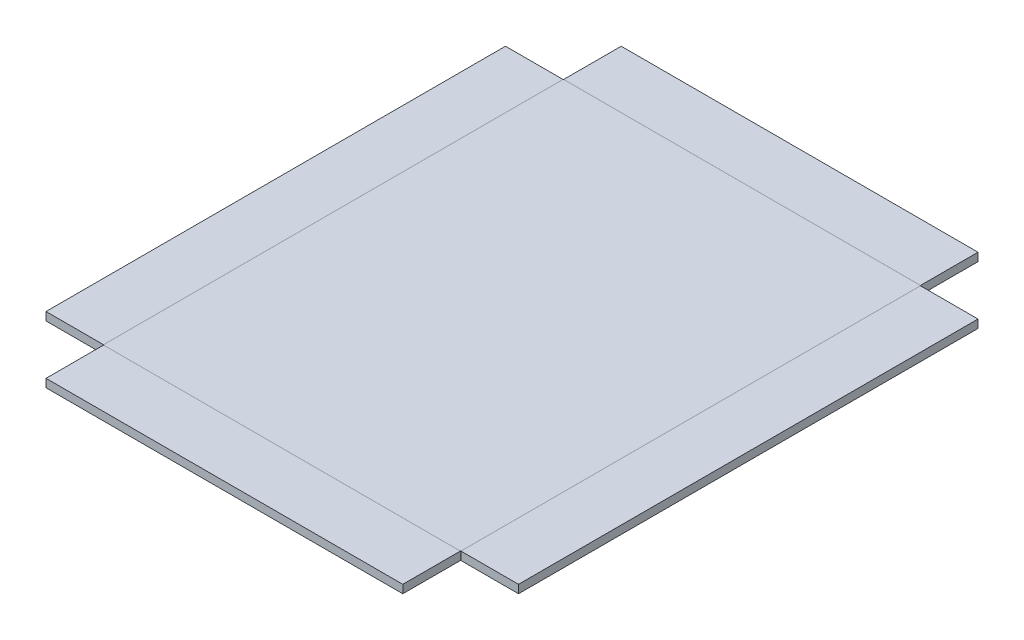
ISO-10303-21;
HEADER;
FILE_DESCRIPTION(('STEP AP214'),'2;1');
FILE_NAME('part.step','',(''),(''),'','','');
FILE_SCHEMA(('AUTOMOTIVE_DESIGN { 1 0 10303 214 1 1 1 1 }'));
ENDSEC;
DATA;
#1=APPLICATION_CONTEXT('core data for automotive mechanical design processes');
#2=APPLICATION_PROTOCOL_DEFINITION('international standard','automotive_design',2000,#1);
#3=PRODUCT_CONTEXT('',#1,'mechanical');
#4=PRODUCT('Part','Part','',(#3));
#5=PRODUCT_RELATED_PRODUCT_CATEGORY('part','',(#4));
#6=PRODUCT_DEFINITION_FORMATION('','',#4);
#7=PRODUCT_DEFINITION_CONTEXT('part definition',#1,'design');
#8=PRODUCT_DEFINITION('design','',#6,#7);
#9=PRODUCT_DEFINITION_SHAPE('','',#8);
#10=(LENGTH_UNIT() NAMED_UNIT(*) SI_UNIT(.MILLI.,.METRE.));
#11=(NAMED_UNIT(*) PLANE_ANGLE_UNIT() SI_UNIT($,.RADIAN.));
#12=(NAMED_UNIT(*) SI_UNIT($,.STERADIAN.) SOLID_ANGLE_UNIT());
#13=UNCERTAINTY_MEASURE_WITH_UNIT(LENGTH_MEASURE(1.E-05),#10,'distance_accuracy_value','');
#14=(GEOMETRIC_REPRESENTATION_CONTEXT(3) GLOBAL_UNCERTAINTY_ASSIGNED_CONTEXT((#13)) GLOBAL_UNIT_ASSIGNED_CONTEXT((#10,
#11,#12)) REPRESENTATION_CONTEXT('',''));
#15=CARTESIAN_POINT('',(0.,0.,0.));
#16=DIRECTION('',(0.,0.,1.));
#17=DIRECTION('',(1.,0.,0.));
#18=AXIS2_PLACEMENT_3D('',#15,#16,#17);
#19=CARTESIAN_POINT('',(0.,-0.254,0.));
#20=DIRECTION('',(0.,-1.,0.));
#21=DIRECTION('',(0.,0.,-1.));
#22=AXIS2_PLACEMENT_3D('',#19,#20,#21);
#23=PLANE('',#22);
#24=DIRECTION('',(0.,0.,-1.));
#25=VECTOR('',#24,1.);
#26=CARTESIAN_POINT('',(5.5245,-0.254,7.112));
#27=LINE('',#26,#25);
#28=CARTESIAN_POINT('',(5.5245,-0.254,7.112));
#29=VERTEX_POINT('',#28);
#30=CARTESIAN_POINT('',(5.5245,-0.254,-7.112));
#31=VERTEX_POINT('',#30);
#32=EDGE_CURVE('E739',#29,#31,#27,.T.);
#33=ORIENTED_EDGE('',*,*,#32,.F.);
#34=DIRECTION('',(1.,0.,0.));
#35=VECTOR('',#34,1.);
#36=CARTESIAN_POINT('',(-5.5245,-0.254,7.112));
#37=LINE('',#36,#35);
#38=CARTESIAN_POINT('',(-5.5245,-0.254,7.112));
#39=VERTEX_POINT('',#38);
#40=EDGE_CURVE('E347',#39,#29,#37,.T.);
#41=ORIENTED_EDGE('',*,*,#40,.F.);
#42=DIRECTION('',(0.,0.,1.));
#43=VECTOR('',#42,1.);
#44=CARTESIAN_POINT('',(-5.5245,-0.254,7.112));
#45=LINE('',#44,#43);
#46=CARTESIAN_POINT('',(-5.5245,-0.254,-7.112));
#47=VERTEX_POINT('',#46);
#48=EDGE_CURVE('E340',#47,#39,#45,.T.);
#49=ORIENTED_EDGE('',*,*,#48,.F.);
#50=DIRECTION('',(-1.,0.,0.));
#51=VECTOR('',#50,1.);
#52=CARTESIAN_POINT('',(-5.5245,-0.254,-7.112));
#53=LINE('',#52,#51);
#54=EDGE_CURVE('E727',#31,#47,#53,.T.);
#55=ORIENTED_EDGE('',*,*,#54,.F.);
#56=EDGE_LOOP('',(#33,#41,#49,#55));
#57=FACE_BOUND('',#56,.T.);
#58=ADVANCED_FACE('F331',(#57),#23,.T.);
#59=CARTESIAN_POINT('',(0.,0.,0.));
#60=DIRECTION('',(0.,-1.,0.));
#61=DIRECTION('',(0.,0.,-1.));
#62=AXIS2_PLACEMENT_3D('',#59,#60,#61);
#63=PLANE('',#62);
#64=DIRECTION('',(0.,0.,-1.));
#65=VECTOR('',#64,1.);
#66=CARTESIAN_POINT('',(5.5245,0.,7.112));
#67=LINE('',#66,#65);
#68=CARTESIAN_POINT('',(5.5245,0.,7.11199999999999));
#69=VERTEX_POINT('',#68);
#70=CARTESIAN_POINT('',(5.52449999999999,0.,-7.112));
#71=VERTEX_POINT('',#70);
#72=EDGE_CURVE('E730',#69,#71,#67,.T.);
#73=ORIENTED_EDGE('',*,*,#72,.T.);
#74=DIRECTION('',(-1.,0.,0.));
#75=VECTOR('',#74,1.);
#76=CARTESIAN_POINT('',(-5.5245,0.,-7.112));
#77=LINE('',#76,#75);
#78=CARTESIAN_POINT('',(-5.5245,0.,-7.11199999999999));
#79=VERTEX_POINT('',#78);
#80=EDGE_CURVE('E719',#71,#79,#77,.T.);
#81=ORIENTED_EDGE('',*,*,#80,.T.);
#82=DIRECTION('',(0.,0.,1.));
#83=VECTOR('',#82,1.);
#84=CARTESIAN_POINT('',(-5.5245,0.,7.112));
#85=LINE('',#84,#83);
#86=CARTESIAN_POINT('',(-5.52449999999998,0.,7.112));
#87=VERTEX_POINT('',#86);
#88=EDGE_CURVE('E764',#79,#87,#85,.T.);
#89=ORIENTED_EDGE('',*,*,#88,.T.);
#90=DIRECTION('',(1.,0.,0.));
#91=VECTOR('',#90,1.);
#92=CARTESIAN_POINT('',(-5.5245,0.,7.112));
#93=LINE('',#92,#91);
#94=EDGE_CURVE('E749',#87,#69,#93,.T.);
#95=ORIENTED_EDGE('',*,*,#94,.T.);
#96=EDGE_LOOP('',(#73,#81,#89,#95));
#97=FACE_BOUND('',#96,.T.);
#98=ADVANCED_FACE('F333',(#97),#63,.F.);
#99=CARTESIAN_POINT('',(-5.5245,-0.254,-7.112));
#100=DIRECTION('',(0.216857826546622,0.,0.976203197631249));
#101=DIRECTION('',(0.976203197631249,0.,-0.216857826546622));
#102=AXIS2_PLACEMENT_3D('',#99,#100,#101);
#103=PLANE('',#102);
#104=DIRECTION('',(0.,1.,0.));
#105=VECTOR('',#104,1.);
#106=CARTESIAN_POINT('',(-5.5245,-0.254,-7.112));
#107=LINE('',#106,#105);
#108=EDGE_CURVE('E771',#47,#79,#107,.T.);
#109=ORIENTED_EDGE('',*,*,#108,.T.);
#110=DIRECTION('',(0.976203197631249,0.,-0.216857826546622));
#111=VECTOR('',#110,1.);
#112=CARTESIAN_POINT('',(-5.5245,0.,-7.11199999999999));
#113=LINE('',#112,#111);
#114=CARTESIAN_POINT('',(-5.51551974387893,0.,-7.11399491133502));
#115=VERTEX_POINT('',#114);
#116=EDGE_CURVE('E723',#79,#115,#113,.T.);
#117=ORIENTED_EDGE('',*,*,#116,.T.);
#118=DIRECTION('',(0.,1.,0.));
#119=VECTOR('',#118,1.);
#120=CARTESIAN_POINT('',(-5.51551974387893,-0.254,-7.11399491133503));
#121=LINE('',#120,#119);
#122=CARTESIAN_POINT('',(-5.51551974387893,-0.254,-7.11399491133503));
#123=VERTEX_POINT('',#122);
#124=EDGE_CURVE('E662',#123,#115,#121,.T.);
#125=ORIENTED_EDGE('',*,*,#124,.F.);
#126=DIRECTION('',(0.976203197631249,0.,-0.216857826546622));
#127=VECTOR('',#126,1.);
#128=CARTESIAN_POINT('',(-5.5245,-0.254,-7.112));
#129=LINE('',#128,#127);
#130=EDGE_CURVE('E355',#47,#123,#129,.T.);
#131=ORIENTED_EDGE('',*,*,#130,.F.);
#132=EDGE_LOOP('',(#109,#117,#125,#131));
#133=FACE_BOUND('',#132,.T.);
#134=ADVANCED_FACE('F833',(#133),#103,.F.);
#135=CARTESIAN_POINT('',(5.51551974387893,-0.254,-7.11399491133503));
#136=DIRECTION('',(-0.216857826546622,0.,0.976203197631249));
#137=DIRECTION('',(0.976203197631249,0.,0.216857826546622));
#138=AXIS2_PLACEMENT_3D('',#135,#136,#137);
#139=PLANE('',#138);
#140=DIRECTION('',(0.,1.,0.));
#141=VECTOR('',#140,1.);
#142=CARTESIAN_POINT('',(5.51551974387893,-0.254,-7.11399491133503));
#143=LINE('',#142,#141);
#144=CARTESIAN_POINT('',(5.51551974387893,-0.254,-7.11399491133503));
#145=VERTEX_POINT('',#144);
#146=CARTESIAN_POINT('',(5.51551974387893,0.,-7.11399491133502));
#147=VERTEX_POINT('',#146);
#148=EDGE_CURVE('E708',#145,#147,#143,.T.);
#149=ORIENTED_EDGE('',*,*,#148,.T.);
#150=DIRECTION('',(0.976203197631249,0.,0.216857826546622));
#151=VECTOR('',#150,1.);
#152=CARTESIAN_POINT('',(5.51551974387893,0.,-7.11399491133502));
#153=LINE('',#152,#151);
#154=EDGE_CURVE('E661',#147,#71,#153,.T.);
#155=ORIENTED_EDGE('',*,*,#154,.T.);
#156=DIRECTION('',(0.,1.,0.));
#157=VECTOR('',#156,1.);
#158=CARTESIAN_POINT('',(5.5245,-0.254,-7.112));
#159=LINE('',#158,#157);
#160=EDGE_CURVE('E743',#31,#71,#159,.T.);
#161=ORIENTED_EDGE('',*,*,#160,.F.);
#162=DIRECTION('',(0.976203197631249,0.,0.216857826546622));
#163=VECTOR('',#162,1.);
#164=CARTESIAN_POINT('',(5.51551974387893,-0.254,-7.11399491133503));
#165=LINE('',#164,#163);
#166=EDGE_CURVE('E720',#145,#31,#165,.T.);
#167=ORIENTED_EDGE('',*,*,#166,.F.);
#168=EDGE_LOOP('',(#149,#155,#161,#167));
#169=FACE_BOUND('',#168,.T.);
#170=ADVANCED_FACE('F835',(#169),#139,.F.);
#171=CARTESIAN_POINT('',(0.,-0.254000000000387,0.));
#172=DIRECTION('',(0.,1.,0.));
#173=DIRECTION('',(0.,0.,1.));
#174=AXIS2_PLACEMENT_3D('',#171,#172,#173);
#175=PLANE('',#174);
#176=ORIENTED_EDGE('',*,*,#166,.T.);
#177=ORIENTED_EDGE('',*,*,#54,.T.);
#178=ORIENTED_EDGE('',*,*,#130,.T.);
#179=DIRECTION('',(-1.,0.,0.));
#180=VECTOR('',#179,1.);
#181=CARTESIAN_POINT('',(-5.5245,-0.254,-7.11399491133503));
#182=LINE('',#181,#180);
#183=EDGE_CURVE('E677',#145,#123,#182,.T.);
#184=ORIENTED_EDGE('',*,*,#183,.F.);
#185=EDGE_LOOP('',(#176,#177,#178,#184));
#186=FACE_BOUND('',#185,.T.);
#187=ADVANCED_FACE('F841',(#186),#175,.F.);
#188=CARTESIAN_POINT('',(0.,-3.86572284599707E-13,0.));
#189=DIRECTION('',(0.,1.,0.));
#190=DIRECTION('',(0.,0.,1.));
#191=AXIS2_PLACEMENT_3D('',#188,#189,#190);
#192=PLANE('',#191);
#193=ORIENTED_EDGE('',*,*,#154,.F.);
#194=DIRECTION('',(-1.,0.,0.));
#195=VECTOR('',#194,1.);
#196=CARTESIAN_POINT('',(-5.5245,0.,-7.11399491133503));
#197=LINE('',#196,#195);
#198=EDGE_CURVE('E652',#147,#115,#197,.T.);
#199=ORIENTED_EDGE('',*,*,#198,.T.);
#200=ORIENTED_EDGE('',*,*,#116,.F.);
#201=ORIENTED_EDGE('',*,*,#80,.F.);
#202=EDGE_LOOP('',(#193,#199,#200,#201));
#203=FACE_BOUND('',#202,.T.);
#204=ADVANCED_FACE('F830',(#203),#192,.T.);
#205=CARTESIAN_POINT('',(-5.5245,0.,-8.89199491133503));
#206=DIRECTION('',(0.,0.,-1.));
#207=DIRECTION('',(0.,1.,0.));
#208=AXIS2_PLACEMENT_3D('',#205,#206,#207);
#209=PLANE('',#208);
#210=DIRECTION('',(0.,1.,0.));
#211=VECTOR('',#210,1.);
#212=CARTESIAN_POINT('',(5.51551974387893,0.,-8.89199491133503));
#213=LINE('',#212,#211);
#214=CARTESIAN_POINT('',(5.51551974387893,-0.253999999999988,-8.89199491133503));
#215=VERTEX_POINT('',#214);
#216=CARTESIAN_POINT('',(5.51551974387893,0.,-8.89199491133503));
#217=VERTEX_POINT('',#216);
#218=EDGE_CURVE('E683',#215,#217,#213,.T.);
#219=ORIENTED_EDGE('',*,*,#218,.F.);
#220=DIRECTION('',(1.,0.,0.));
#221=VECTOR('',#220,1.);
#222=CARTESIAN_POINT('',(-5.5245,-0.253999999999988,-8.89199491133503));
#223=LINE('',#222,#221);
#224=CARTESIAN_POINT('',(-5.51551974387893,-0.253999999999988,-8.89199491133503));
#225=VERTEX_POINT('',#224);
#226=EDGE_CURVE('E668',#225,#215,#223,.T.);
#227=ORIENTED_EDGE('',*,*,#226,.F.);
#228=DIRECTION('',(0.,1.,0.));
#229=VECTOR('',#228,1.);
#230=CARTESIAN_POINT('',(-5.51551974387893,0.,-8.89199491133503));
#231=LINE('',#230,#229);
#232=CARTESIAN_POINT('',(-5.51551974387893,0.,-8.89199491133503));
#233=VERTEX_POINT('',#232);
#234=EDGE_CURVE('E704',#225,#233,#231,.T.);
#235=ORIENTED_EDGE('',*,*,#234,.T.);
#236=DIRECTION('',(1.,0.,0.));
#237=VECTOR('',#236,1.);
#238=CARTESIAN_POINT('',(-5.5245,0.,-8.89199491133503));
#239=LINE('',#238,#237);
#240=EDGE_CURVE('E698',#233,#217,#239,.T.);
#241=ORIENTED_EDGE('',*,*,#240,.T.);
#242=EDGE_LOOP('',(#219,#227,#235,#241));
#243=FACE_BOUND('',#242,.T.);
#244=ADVANCED_FACE('F940',(#243),#209,.T.);
#245=CARTESIAN_POINT('',(0.,0.,-6.859994911335));
#246=DIRECTION('',(0.,-1.,0.));
#247=DIRECTION('',(0.,0.,-1.));
#248=AXIS2_PLACEMENT_3D('',#245,#246,#247);
#249=PLANE('',#248);
#250=ORIENTED_EDGE('',*,*,#198,.F.);
#251=DIRECTION('',(0.,0.,-1.));
#252=VECTOR('',#251,1.);
#253=CARTESIAN_POINT('',(5.51551974387893,0.,-6.859994911335));
#254=LINE('',#253,#252);
#255=EDGE_CURVE('E693',#147,#217,#254,.T.);
#256=ORIENTED_EDGE('',*,*,#255,.T.);
#257=ORIENTED_EDGE('',*,*,#240,.F.);
#258=DIRECTION('',(0.,0.,-1.));
#259=VECTOR('',#258,1.);
#260=CARTESIAN_POINT('',(-5.51551974387893,0.,-6.859994911335));
#261=LINE('',#260,#259);
#262=EDGE_CURVE('E658',#115,#233,#261,.T.);
#263=ORIENTED_EDGE('',*,*,#262,.F.);
#264=EDGE_LOOP('',(#250,#256,#257,#263));
#265=FACE_BOUND('',#264,.T.);
#266=ADVANCED_FACE('F943',(#265),#249,.F.);
#267=CARTESIAN_POINT('',(5.51551974387893,-0.254,-7.11399491133503));
#268=DIRECTION('',(-1.,0.,0.));
#269=DIRECTION('',(0.,-1.,0.));
#270=AXIS2_PLACEMENT_3D('',#267,#268,#269);
#271=PLANE('',#270);
#272=DIRECTION('',(0.,0.,-1.));
#273=VECTOR('',#272,1.);
#274=CARTESIAN_POINT('',(5.51551974387893,-0.254,-7.11399491133503));
#275=LINE('',#274,#273);
#276=EDGE_CURVE('E689',#145,#215,#275,.T.);
#277=ORIENTED_EDGE('',*,*,#276,.T.);
#278=ORIENTED_EDGE('',*,*,#218,.T.);
#279=ORIENTED_EDGE('',*,*,#255,.F.);
#280=ORIENTED_EDGE('',*,*,#148,.F.);
#281=EDGE_LOOP('',(#277,#278,#279,#280));
#282=FACE_BOUND('',#281,.T.);
#283=ADVANCED_FACE('F947',(#282),#271,.F.);
#284=CARTESIAN_POINT('',(0.,-0.254000000000002,-6.85999491133501));
#285=DIRECTION('',(0.,-1.,0.));
#286=DIRECTION('',(0.,0.,-1.));
#287=AXIS2_PLACEMENT_3D('',#284,#285,#286);
#288=PLANE('',#287);
#289=ORIENTED_EDGE('',*,*,#276,.F.);
#290=ORIENTED_EDGE('',*,*,#183,.T.);
#291=DIRECTION('',(0.,0.,-1.));
#292=VECTOR('',#291,1.);
#293=CARTESIAN_POINT('',(-5.51551974387893,-0.254,-7.11399491133503));
#294=LINE('',#293,#292);
#295=EDGE_CURVE('E673',#123,#225,#294,.T.);
#296=ORIENTED_EDGE('',*,*,#295,.T.);
#297=ORIENTED_EDGE('',*,*,#226,.T.);
#298=EDGE_LOOP('',(#289,#290,#296,#297));
#299=FACE_BOUND('',#298,.T.);
#300=ADVANCED_FACE('F951',(#299),#288,.T.);
#301=CARTESIAN_POINT('',(-5.51551974387893,-0.254,-7.11399491133503));
#302=DIRECTION('',(-1.,0.,0.));
#303=DIRECTION('',(0.,-1.,0.));
#304=AXIS2_PLACEMENT_3D('',#301,#302,#303);
#305=PLANE('',#304);
#306=ORIENTED_EDGE('',*,*,#234,.F.);
#307=ORIENTED_EDGE('',*,*,#295,.F.);
#308=ORIENTED_EDGE('',*,*,#124,.T.);
#309=ORIENTED_EDGE('',*,*,#262,.T.);
#310=EDGE_LOOP('',(#306,#307,#308,#309));
#311=FACE_BOUND('',#310,.T.);
#312=ADVANCED_FACE('F938',(#311),#305,.T.);
#313=CARTESIAN_POINT('',(5.5245,-0.254,-7.112));
#314=DIRECTION('',(-0.976203197631269,0.,0.216857826546532));
#315=DIRECTION('',(0.216857826546532,0.,0.976203197631269));
#316=AXIS2_PLACEMENT_3D('',#313,#314,#315);
#317=PLANE('',#316);
#318=ORIENTED_EDGE('',*,*,#160,.T.);
#319=DIRECTION('',(0.216857826546532,0.,0.976203197631269));
#320=VECTOR('',#319,1.);
#321=CARTESIAN_POINT('',(5.52449999999999,0.,-7.112));
#322=LINE('',#321,#320);
#323=CARTESIAN_POINT('',(5.52649491133502,0.,-7.10301974387893));
#324=VERTEX_POINT('',#323);
#325=EDGE_CURVE('E656',#71,#324,#322,.T.);
#326=ORIENTED_EDGE('',*,*,#325,.T.);
#327=DIRECTION('',(0.,1.,0.));
#328=VECTOR('',#327,1.);
#329=CARTESIAN_POINT('',(5.52649491133503,-0.254,-7.10301974387893));
#330=LINE('',#329,#328);
#331=CARTESIAN_POINT('',(5.52649491133503,-0.254,-7.10301974387893));
#332=VERTEX_POINT('',#331);
#333=EDGE_CURVE('E595',#332,#324,#330,.T.);
#334=ORIENTED_EDGE('',*,*,#333,.F.);
#335=DIRECTION('',(0.216857826546532,0.,0.976203197631269));
#336=VECTOR('',#335,1.);
#337=CARTESIAN_POINT('',(5.5245,-0.254,-7.112));
#338=LINE('',#337,#336);
#339=EDGE_CURVE('E649',#31,#332,#338,.T.);
#340=ORIENTED_EDGE('',*,*,#339,.F.);
#341=EDGE_LOOP('',(#318,#326,#334,#340));
#342=FACE_BOUND('',#341,.T.);
#343=ADVANCED_FACE('F935',(#342),#317,.F.);
#344=CARTESIAN_POINT('',(5.52649491133503,-0.254,7.10301974387893));
#345=DIRECTION('',(-0.976203197631269,0.,-0.216857826546532));
#346=DIRECTION('',(-0.216857826546532,0.,0.976203197631269));
#347=AXIS2_PLACEMENT_3D('',#344,#345,#346);
#348=PLANE('',#347);
#349=DIRECTION('',(0.,1.,0.));
#350=VECTOR('',#349,1.);
#351=CARTESIAN_POINT('',(5.52649491133503,-0.254,7.10301974387893));
#352=LINE('',#351,#350);
#353=CARTESIAN_POINT('',(5.52649491133503,-0.254,7.10301974387893));
#354=VERTEX_POINT('',#353);
#355=CARTESIAN_POINT('',(5.52649491133502,0.,7.10301974387893));
#356=VERTEX_POINT('',#355);
#357=EDGE_CURVE('E639',#354,#356,#352,.T.);
#358=ORIENTED_EDGE('',*,*,#357,.T.);
#359=DIRECTION('',(-0.216857826546532,0.,0.976203197631269));
#360=VECTOR('',#359,1.);
#361=CARTESIAN_POINT('',(5.52649491133502,0.,7.10301974387893));
#362=LINE('',#361,#360);
#363=EDGE_CURVE('E594',#356,#69,#362,.T.);
#364=ORIENTED_EDGE('',*,*,#363,.T.);
#365=DIRECTION('',(0.,1.,0.));
#366=VECTOR('',#365,1.);
#367=CARTESIAN_POINT('',(5.5245,-0.254,7.112));
#368=LINE('',#367,#366);
#369=EDGE_CURVE('E758',#29,#69,#368,.T.);
#370=ORIENTED_EDGE('',*,*,#369,.F.);
#371=DIRECTION('',(-0.216857826546532,0.,0.976203197631269));
#372=VECTOR('',#371,1.);
#373=CARTESIAN_POINT('',(5.52649491133503,-0.254,7.10301974387893));
#374=LINE('',#373,#372);
#375=EDGE_CURVE('E653',#354,#29,#374,.T.);
#376=ORIENTED_EDGE('',*,*,#375,.F.);
#377=EDGE_LOOP('',(#358,#364,#370,#376));
#378=FACE_BOUND('',#377,.T.);
#379=ADVANCED_FACE('F854',(#378),#348,.F.);
#380=CARTESIAN_POINT('',(0.,-0.2540000000003,0.));
#381=DIRECTION('',(0.,1.,0.));
#382=DIRECTION('',(-1.,0.,0.));
#383=AXIS2_PLACEMENT_3D('',#380,#381,#382);
#384=PLANE('',#383);
#385=ORIENTED_EDGE('',*,*,#375,.T.);
#386=ORIENTED_EDGE('',*,*,#32,.T.);
#387=ORIENTED_EDGE('',*,*,#339,.T.);
#388=DIRECTION('',(0.,0.,-1.));
#389=VECTOR('',#388,1.);
#390=CARTESIAN_POINT('',(5.52649491133503,-0.254,-7.112));
#391=LINE('',#390,#389);
#392=EDGE_CURVE('E608',#354,#332,#391,.T.);
#393=ORIENTED_EDGE('',*,*,#392,.F.);
#394=EDGE_LOOP('',(#385,#386,#387,#393));
#395=FACE_BOUND('',#394,.T.);
#396=ADVANCED_FACE('F851',(#395),#384,.F.);
#397=CARTESIAN_POINT('',(0.,-3.0026979166986E-13,0.));
#398=DIRECTION('',(0.,1.,0.));
#399=DIRECTION('',(-1.,0.,0.));
#400=AXIS2_PLACEMENT_3D('',#397,#398,#399);
#401=PLANE('',#400);
#402=ORIENTED_EDGE('',*,*,#363,.F.);
#403=DIRECTION('',(0.,0.,-1.));
#404=VECTOR('',#403,1.);
#405=CARTESIAN_POINT('',(5.52649491133503,0.,-7.112));
#406=LINE('',#405,#404);
#407=EDGE_CURVE('E586',#356,#324,#406,.T.);
#408=ORIENTED_EDGE('',*,*,#407,.T.);
#409=ORIENTED_EDGE('',*,*,#325,.F.);
#410=ORIENTED_EDGE('',*,*,#72,.F.);
#411=EDGE_LOOP('',(#402,#408,#409,#410));
#412=FACE_BOUND('',#411,.T.);
#413=ADVANCED_FACE('F912',(#412),#401,.T.);
#414=CARTESIAN_POINT('',(7.30449491133503,0.,-7.112));
#415=DIRECTION('',(1.,0.,0.));
#416=DIRECTION('',(0.,1.,0.));
#417=AXIS2_PLACEMENT_3D('',#414,#415,#416);
#418=PLANE('',#417);
#419=DIRECTION('',(0.,1.,0.));
#420=VECTOR('',#419,1.);
#421=CARTESIAN_POINT('',(7.30449491133503,0.,7.10301974387893));
#422=LINE('',#421,#420);
#423=CARTESIAN_POINT('',(7.30449491133503,-0.253999999999988,7.10301974387893));
#424=VERTEX_POINT('',#423);
#425=CARTESIAN_POINT('',(7.30449491133503,0.,7.10301974387893));
#426=VERTEX_POINT('',#425);
#427=EDGE_CURVE('E614',#424,#426,#422,.T.);
#428=ORIENTED_EDGE('',*,*,#427,.F.);
#429=DIRECTION('',(0.,0.,1.));
#430=VECTOR('',#429,1.);
#431=CARTESIAN_POINT('',(7.30449491133503,-0.253999999999988,-7.112));
#432=LINE('',#431,#430);
#433=CARTESIAN_POINT('',(7.30449491133503,-0.253999999999988,-7.10301974387893));
#434=VERTEX_POINT('',#433);
#435=EDGE_CURVE('E599',#434,#424,#432,.T.);
#436=ORIENTED_EDGE('',*,*,#435,.F.);
#437=DIRECTION('',(0.,1.,0.));
#438=VECTOR('',#437,1.);
#439=CARTESIAN_POINT('',(7.30449491133503,0.,-7.10301974387893));
#440=LINE('',#439,#438);
#441=CARTESIAN_POINT('',(7.30449491133503,0.,-7.10301974387893));
#442=VERTEX_POINT('',#441);
#443=EDGE_CURVE('E635',#434,#442,#440,.T.);
#444=ORIENTED_EDGE('',*,*,#443,.T.);
#445=DIRECTION('',(0.,0.,1.));
#446=VECTOR('',#445,1.);
#447=CARTESIAN_POINT('',(7.30449491133503,0.,-7.112));
#448=LINE('',#447,#446);
#449=EDGE_CURVE('E629',#442,#426,#448,.T.);
#450=ORIENTED_EDGE('',*,*,#449,.T.);
#451=EDGE_LOOP('',(#428,#436,#444,#450));
#452=FACE_BOUND('',#451,.T.);
#453=ADVANCED_FACE('F908',(#452),#418,.T.);
#454=CARTESIAN_POINT('',(5.27249491133501,0.,0.));
#455=DIRECTION('',(0.,-1.,0.));
#456=DIRECTION('',(1.,0.,0.));
#457=AXIS2_PLACEMENT_3D('',#454,#455,#456);
#458=PLANE('',#457);
#459=ORIENTED_EDGE('',*,*,#407,.F.);
#460=DIRECTION('',(1.,0.,0.));
#461=VECTOR('',#460,1.);
#462=CARTESIAN_POINT('',(5.27249491133501,0.,7.10301974387893));
#463=LINE('',#462,#461);
#464=EDGE_CURVE('E624',#356,#426,#463,.T.);
#465=ORIENTED_EDGE('',*,*,#464,.T.);
#466=ORIENTED_EDGE('',*,*,#449,.F.);
#467=DIRECTION('',(1.,0.,0.));
#468=VECTOR('',#467,1.);
#469=CARTESIAN_POINT('',(5.27249491133501,0.,-7.10301974387893));
#470=LINE('',#469,#468);
#471=EDGE_CURVE('E591',#324,#442,#470,.T.);
#472=ORIENTED_EDGE('',*,*,#471,.F.);
#473=EDGE_LOOP('',(#459,#465,#466,#472));
#474=FACE_BOUND('',#473,.T.);
#475=ADVANCED_FACE('F911',(#474),#458,.F.);
#476=CARTESIAN_POINT('',(5.52649491133503,-0.254,7.10301974387893));
#477=DIRECTION('',(0.,0.,-1.));
#478=DIRECTION('',(-1.,0.,0.));
#479=AXIS2_PLACEMENT_3D('',#476,#477,#478);
#480=PLANE('',#479);
#481=DIRECTION('',(1.,0.,0.));
#482=VECTOR('',#481,1.);
#483=CARTESIAN_POINT('',(5.52649491133503,-0.254,7.10301974387893));
#484=LINE('',#483,#482);
#485=EDGE_CURVE('E620',#354,#424,#484,.T.);
#486=ORIENTED_EDGE('',*,*,#485,.T.);
#487=ORIENTED_EDGE('',*,*,#427,.T.);
#488=ORIENTED_EDGE('',*,*,#464,.F.);
#489=ORIENTED_EDGE('',*,*,#357,.F.);
#490=EDGE_LOOP('',(#486,#487,#488,#489));
#491=FACE_BOUND('',#490,.T.);
#492=ADVANCED_FACE('F916',(#491),#480,.F.);
#493=CARTESIAN_POINT('',(5.27249491133501,-0.254000000000002,0.));
#494=DIRECTION('',(0.,-1.,0.));
#495=DIRECTION('',(1.,0.,0.));
#496=AXIS2_PLACEMENT_3D('',#493,#494,#495);
#497=PLANE('',#496);
#498=ORIENTED_EDGE('',*,*,#485,.F.);
#499=ORIENTED_EDGE('',*,*,#392,.T.);
#500=DIRECTION('',(1.,0.,0.));
#501=VECTOR('',#500,1.);
#502=CARTESIAN_POINT('',(5.52649491133503,-0.254,-7.10301974387893));
#503=LINE('',#502,#501);
#504=EDGE_CURVE('E604',#332,#434,#503,.T.);
#505=ORIENTED_EDGE('',*,*,#504,.T.);
#506=ORIENTED_EDGE('',*,*,#435,.T.);
#507=EDGE_LOOP('',(#498,#499,#505,#506));
#508=FACE_BOUND('',#507,.T.);
#509=ADVANCED_FACE('F920',(#508),#497,.T.);
#510=CARTESIAN_POINT('',(5.52649491133503,-0.254,-7.10301974387893));
#511=DIRECTION('',(0.,0.,-1.));
#512=DIRECTION('',(-1.,0.,0.));
#513=AXIS2_PLACEMENT_3D('',#510,#511,#512);
#514=PLANE('',#513);
#515=ORIENTED_EDGE('',*,*,#443,.F.);
#516=ORIENTED_EDGE('',*,*,#504,.F.);
#517=ORIENTED_EDGE('',*,*,#333,.T.);
#518=ORIENTED_EDGE('',*,*,#471,.T.);
#519=EDGE_LOOP('',(#515,#516,#517,#518));
#520=FACE_BOUND('',#519,.T.);
#521=ADVANCED_FACE('F907',(#520),#514,.T.);
#522=CARTESIAN_POINT('',(5.5245,-0.254,7.112));
#523=DIRECTION('',(-0.216857826546622,0.,-0.976203197631249));
#524=DIRECTION('',(-0.976203197631249,0.,0.216857826546622));
#525=AXIS2_PLACEMENT_3D('',#522,#523,#524);
#526=PLANE('',#525);
#527=ORIENTED_EDGE('',*,*,#369,.T.);
#528=DIRECTION('',(-0.976203197631249,0.,0.216857826546622));
#529=VECTOR('',#528,1.);
#530=CARTESIAN_POINT('',(5.5245,0.,7.11199999999999));
#531=LINE('',#530,#529);
#532=CARTESIAN_POINT('',(5.51551974387893,0.,7.11399491133502));
#533=VERTEX_POINT('',#532);
#534=EDGE_CURVE('E589',#69,#533,#531,.T.);
#535=ORIENTED_EDGE('',*,*,#534,.T.);
#536=DIRECTION('',(0.,1.,0.));
#537=VECTOR('',#536,1.);
#538=CARTESIAN_POINT('',(5.51551974387893,-0.254,7.11399491133503));
#539=LINE('',#538,#537);
#540=CARTESIAN_POINT('',(5.51551974387893,-0.254,7.11399491133503));
#541=VERTEX_POINT('',#540);
#542=EDGE_CURVE('E529',#541,#533,#539,.T.);
#543=ORIENTED_EDGE('',*,*,#542,.F.);
#544=DIRECTION('',(-0.976203197631249,0.,0.216857826546622));
#545=VECTOR('',#544,1.);
#546=CARTESIAN_POINT('',(5.5245,-0.254,7.112));
#547=LINE('',#546,#545);
#548=EDGE_CURVE('E583',#29,#541,#547,.T.);
#549=ORIENTED_EDGE('',*,*,#548,.F.);
#550=EDGE_LOOP('',(#527,#535,#543,#549));
#551=FACE_BOUND('',#550,.T.);
#552=ADVANCED_FACE('F863',(#551),#526,.F.);
#553=CARTESIAN_POINT('',(-5.51551974387893,-0.254,7.11399491133503));
#554=DIRECTION('',(0.216857826546622,0.,-0.976203197631249));
#555=DIRECTION('',(-0.976203197631249,0.,-0.216857826546622));
#556=AXIS2_PLACEMENT_3D('',#553,#554,#555);
#557=PLANE('',#556);
#558=DIRECTION('',(0.,1.,0.));
#559=VECTOR('',#558,1.);
#560=CARTESIAN_POINT('',(-5.51551974387893,-0.254,7.11399491133503));
#561=LINE('',#560,#559);
#562=CARTESIAN_POINT('',(-5.51551974387893,-0.254,7.11399491133503));
#563=VERTEX_POINT('',#562);
#564=CARTESIAN_POINT('',(-5.51551974387893,0.,7.11399491133502));
#565=VERTEX_POINT('',#564);
#566=EDGE_CURVE('E573',#563,#565,#561,.T.);
#567=ORIENTED_EDGE('',*,*,#566,.T.);
#568=DIRECTION('',(-0.976203197631249,0.,-0.216857826546622));
#569=VECTOR('',#568,1.);
#570=CARTESIAN_POINT('',(-5.51551974387893,0.,7.11399491133502));
#571=LINE('',#570,#569);
#572=EDGE_CURVE('E528',#565,#87,#571,.T.);
#573=ORIENTED_EDGE('',*,*,#572,.T.);
#574=DIRECTION('',(0.,1.,0.));
#575=VECTOR('',#574,1.);
#576=CARTESIAN_POINT('',(-5.5245,-0.254,7.112));
#577=LINE('',#576,#575);
#578=EDGE_CURVE('E13',#39,#87,#577,.T.);
#579=ORIENTED_EDGE('',*,*,#578,.F.);
#580=DIRECTION('',(-0.976203197631249,0.,-0.216857826546622));
#581=VECTOR('',#580,1.);
#582=CARTESIAN_POINT('',(-5.51551974387893,-0.254,7.11399491133503));
#583=LINE('',#582,#581);
#584=EDGE_CURVE('E587',#563,#39,#583,.T.);
#585=ORIENTED_EDGE('',*,*,#584,.F.);
#586=EDGE_LOOP('',(#567,#573,#579,#585));
#587=FACE_BOUND('',#586,.T.);
#588=ADVANCED_FACE('F873',(#587),#557,.F.);
#589=CARTESIAN_POINT('',(0.,-0.254000000000387,0.));
#590=DIRECTION('',(0.,1.,0.));
#591=DIRECTION('',(0.,0.,1.));
#592=AXIS2_PLACEMENT_3D('',#589,#590,#591);
#593=PLANE('',#592);
#594=ORIENTED_EDGE('',*,*,#584,.T.);
#595=ORIENTED_EDGE('',*,*,#40,.T.);
#596=ORIENTED_EDGE('',*,*,#548,.T.);
#597=DIRECTION('',(1.,0.,0.));
#598=VECTOR('',#597,1.);
#599=CARTESIAN_POINT('',(5.5245,-0.254,7.11399491133503));
#600=LINE('',#599,#598);
#601=EDGE_CURVE('E542',#563,#541,#600,.T.);
#602=ORIENTED_EDGE('',*,*,#601,.F.);
#603=EDGE_LOOP('',(#594,#595,#596,#602));
#604=FACE_BOUND('',#603,.T.);
#605=ADVANCED_FACE('F860',(#604),#593,.F.);
#606=CARTESIAN_POINT('',(0.,-3.86572284599707E-13,0.));
#607=DIRECTION('',(0.,1.,0.));
#608=DIRECTION('',(0.,0.,1.));
#609=AXIS2_PLACEMENT_3D('',#606,#607,#608);
#610=PLANE('',#609);
#611=ORIENTED_EDGE('',*,*,#572,.F.);
#612=DIRECTION('',(1.,0.,0.));
#613=VECTOR('',#612,1.);
#614=CARTESIAN_POINT('',(5.5245,0.,7.11399491133503));
#615=LINE('',#614,#613);
#616=EDGE_CURVE('E516',#565,#533,#615,.T.);
#617=ORIENTED_EDGE('',*,*,#616,.T.);
#618=ORIENTED_EDGE('',*,*,#534,.F.);
#619=ORIENTED_EDGE('',*,*,#94,.F.);
#620=EDGE_LOOP('',(#611,#617,#618,#619));
#621=FACE_BOUND('',#620,.T.);
#622=ADVANCED_FACE('F877',(#621),#610,.T.);
#623=CARTESIAN_POINT('',(5.5245,0.,8.89199491133503));
#624=DIRECTION('',(0.,0.,1.));
#625=DIRECTION('',(0.,-1.,0.));
#626=AXIS2_PLACEMENT_3D('',#623,#624,#625);
#627=PLANE('',#626);
#628=DIRECTION('',(0.,1.,0.));
#629=VECTOR('',#628,1.);
#630=CARTESIAN_POINT('',(-5.51551974387893,0.,8.89199491133503));
#631=LINE('',#630,#629);
#632=CARTESIAN_POINT('',(-5.51551974387893,-0.253999999999988,8.89199491133503));
#633=VERTEX_POINT('',#632);
#634=CARTESIAN_POINT('',(-5.51551974387893,0.,8.89199491133503));
#635=VERTEX_POINT('',#634);
#636=EDGE_CURVE('E548',#633,#635,#631,.T.);
#637=ORIENTED_EDGE('',*,*,#636,.F.);
#638=DIRECTION('',(-1.,0.,0.));
#639=VECTOR('',#638,1.);
#640=CARTESIAN_POINT('',(5.5245,-0.253999999999988,8.89199491133503));
#641=LINE('',#640,#639);
#642=CARTESIAN_POINT('',(5.51551974387893,-0.253999999999988,8.89199491133503));
#643=VERTEX_POINT('',#642);
#644=EDGE_CURVE('E533',#643,#633,#641,.T.);
#645=ORIENTED_EDGE('',*,*,#644,.F.);
#646=DIRECTION('',(0.,1.,0.));
#647=VECTOR('',#646,1.);
#648=CARTESIAN_POINT('',(5.51551974387893,0.,8.89199491133503));
#649=LINE('',#648,#647);
#650=CARTESIAN_POINT('',(5.51551974387893,0.,8.89199491133503));
#651=VERTEX_POINT('',#650);
#652=EDGE_CURVE('E569',#643,#651,#649,.T.);
#653=ORIENTED_EDGE('',*,*,#652,.T.);
#654=DIRECTION('',(-1.,0.,0.));
#655=VECTOR('',#654,1.);
#656=CARTESIAN_POINT('',(5.5245,0.,8.89199491133503));
#657=LINE('',#656,#655);
#658=EDGE_CURVE('E563',#651,#635,#657,.T.);
#659=ORIENTED_EDGE('',*,*,#658,.T.);
#660=EDGE_LOOP('',(#637,#645,#653,#659));
#661=FACE_BOUND('',#660,.T.);
#662=ADVANCED_FACE('F884',(#661),#627,.T.);
#663=CARTESIAN_POINT('',(0.,0.,6.859994911335));
#664=DIRECTION('',(0.,-1.,0.));
#665=DIRECTION('',(0.,0.,-1.));
#666=AXIS2_PLACEMENT_3D('',#663,#664,#665);
#667=PLANE('',#666);
#668=ORIENTED_EDGE('',*,*,#616,.F.);
#669=DIRECTION('',(0.,0.,1.));
#670=VECTOR('',#669,1.);
#671=CARTESIAN_POINT('',(-5.51551974387893,0.,6.859994911335));
#672=LINE('',#671,#670);
#673=EDGE_CURVE('E558',#565,#635,#672,.T.);
#674=ORIENTED_EDGE('',*,*,#673,.T.);
#675=ORIENTED_EDGE('',*,*,#658,.F.);
#676=DIRECTION('',(0.,0.,1.));
#677=VECTOR('',#676,1.);
#678=CARTESIAN_POINT('',(5.51551974387893,0.,6.859994911335));
#679=LINE('',#678,#677);
#680=EDGE_CURVE('E525',#533,#651,#679,.T.);
#681=ORIENTED_EDGE('',*,*,#680,.F.);
#682=EDGE_LOOP('',(#668,#674,#675,#681));
#683=FACE_BOUND('',#682,.T.);
#684=ADVANCED_FACE('F881',(#683),#667,.F.);
#685=CARTESIAN_POINT('',(-5.51551974387893,-0.254,7.11399491133503));
#686=DIRECTION('',(1.,0.,0.));
#687=DIRECTION('',(0.,-1.,0.));
#688=AXIS2_PLACEMENT_3D('',#685,#686,#687);
#689=PLANE('',#688);
#690=DIRECTION('',(0.,0.,1.));
#691=VECTOR('',#690,1.);
#692=CARTESIAN_POINT('',(-5.51551974387893,-0.254,7.11399491133503));
#693=LINE('',#692,#691);
#694=EDGE_CURVE('E554',#563,#633,#693,.T.);
#695=ORIENTED_EDGE('',*,*,#694,.T.);
#696=ORIENTED_EDGE('',*,*,#636,.T.);
#697=ORIENTED_EDGE('',*,*,#673,.F.);
#698=ORIENTED_EDGE('',*,*,#566,.F.);
#699=EDGE_LOOP('',(#695,#696,#697,#698));
#700=FACE_BOUND('',#699,.T.);
#701=ADVANCED_FACE('F886',(#700),#689,.F.);
#702=CARTESIAN_POINT('',(0.,-0.254000000000002,6.85999491133501));
#703=DIRECTION('',(0.,-1.,0.));
#704=DIRECTION('',(0.,0.,-1.));
#705=AXIS2_PLACEMENT_3D('',#702,#703,#704);
#706=PLANE('',#705);
#707=ORIENTED_EDGE('',*,*,#694,.F.);
#708=ORIENTED_EDGE('',*,*,#601,.T.);
#709=DIRECTION('',(0.,0.,1.));
#710=VECTOR('',#709,1.);
#711=CARTESIAN_POINT('',(5.51551974387893,-0.254,7.11399491133503));
#712=LINE('',#711,#710);
#713=EDGE_CURVE('E538',#541,#643,#712,.T.);
#714=ORIENTED_EDGE('',*,*,#713,.T.);
#715=ORIENTED_EDGE('',*,*,#644,.T.);
#716=EDGE_LOOP('',(#707,#708,#714,#715));
#717=FACE_BOUND('',#716,.T.);
#718=ADVANCED_FACE('F870',(#717),#706,.T.);
#719=CARTESIAN_POINT('',(5.51551974387893,-0.254,7.11399491133503));
#720=DIRECTION('',(1.,0.,0.));
#721=DIRECTION('',(0.,-1.,0.));
#722=AXIS2_PLACEMENT_3D('',#719,#720,#721);
#723=PLANE('',#722);
#724=ORIENTED_EDGE('',*,*,#652,.F.);
#725=ORIENTED_EDGE('',*,*,#713,.F.);
#726=ORIENTED_EDGE('',*,*,#542,.T.);
#727=ORIENTED_EDGE('',*,*,#680,.T.);
#728=EDGE_LOOP('',(#724,#725,#726,#727));
#729=FACE_BOUND('',#728,.T.);
#730=ADVANCED_FACE('F865',(#729),#723,.T.);
#731=CARTESIAN_POINT('',(-5.5245,-0.254,7.112));
#732=DIRECTION('',(0.976203197631269,0.,-0.216857826546532));
#733=DIRECTION('',(-0.216857826546532,0.,-0.976203197631269));
#734=AXIS2_PLACEMENT_3D('',#731,#732,#733);
#735=PLANE('',#734);
#736=ORIENTED_EDGE('',*,*,#578,.T.);
#737=DIRECTION('',(-0.216857826546532,0.,-0.976203197631269));
#738=VECTOR('',#737,1.);
#739=CARTESIAN_POINT('',(-5.52449999999998,0.,7.112));
#740=LINE('',#739,#738);
#741=CARTESIAN_POINT('',(-5.52649491133501,0.,7.10301974387893));
#742=VERTEX_POINT('',#741);
#743=EDGE_CURVE('E520',#87,#742,#740,.T.);
#744=ORIENTED_EDGE('',*,*,#743,.T.);
#745=DIRECTION('',(0.,1.,0.));
#746=VECTOR('',#745,1.);
#747=CARTESIAN_POINT('',(-5.52649491133503,-0.254,7.10301974387893));
#748=LINE('',#747,#746);
#749=CARTESIAN_POINT('',(-5.52649491133503,-0.254,7.10301974387893));
#750=VERTEX_POINT('',#749);
#751=EDGE_CURVE('E482',#750,#742,#748,.T.);
#752=ORIENTED_EDGE('',*,*,#751,.F.);
#753=DIRECTION('',(-0.216857826546532,0.,-0.976203197631269));
#754=VECTOR('',#753,1.);
#755=CARTESIAN_POINT('',(-5.5245,-0.254,7.112));
#756=LINE('',#755,#754);
#757=EDGE_CURVE('E513',#39,#750,#756,.T.);
#758=ORIENTED_EDGE('',*,*,#757,.F.);
#759=EDGE_LOOP('',(#736,#744,#752,#758));
#760=FACE_BOUND('',#759,.T.);
#761=ADVANCED_FACE('F784',(#760),#735,.F.);
#762=CARTESIAN_POINT('',(-5.52649491133503,-0.254,-7.10301974387893));
#763=DIRECTION('',(0.976203197631269,0.,0.216857826546532));
#764=DIRECTION('',(0.216857826546532,0.,-0.976203197631269));
#765=AXIS2_PLACEMENT_3D('',#762,#763,#764);
#766=PLANE('',#765);
#767=DIRECTION('',(0.,1.,0.));
#768=VECTOR('',#767,1.);
#769=CARTESIAN_POINT('',(-5.52649491133503,-0.254,-7.10301974387893));
#770=LINE('',#769,#768);
#771=CARTESIAN_POINT('',(-5.52649491133503,-0.254,-7.10301974387893));
#772=VERTEX_POINT('',#771);
#773=CARTESIAN_POINT('',(-5.52649491133501,0.,-7.10301974387893));
#774=VERTEX_POINT('',#773);
#775=EDGE_CURVE('E500',#772,#774,#770,.T.);
#776=ORIENTED_EDGE('',*,*,#775,.T.);
#777=DIRECTION('',(0.216857826546532,0.,-0.976203197631269));
#778=VECTOR('',#777,1.);
#779=CARTESIAN_POINT('',(-5.52649491133501,0.,-7.10301974387893));
#780=LINE('',#779,#778);
#781=EDGE_CURVE('E521',#774,#79,#780,.T.);
#782=ORIENTED_EDGE('',*,*,#781,.T.);
#783=ORIENTED_EDGE('',*,*,#108,.F.);
#784=DIRECTION('',(0.216857826546532,0.,-0.976203197631269));
#785=VECTOR('',#784,1.);
#786=CARTESIAN_POINT('',(-5.52649491133503,-0.254,-7.10301974387893));
#787=LINE('',#786,#785);
#788=EDGE_CURVE('E517',#772,#47,#787,.T.);
#789=ORIENTED_EDGE('',*,*,#788,.F.);
#790=EDGE_LOOP('',(#776,#782,#783,#789));
#791=FACE_BOUND('',#790,.T.);
#792=ADVANCED_FACE('F819',(#791),#766,.F.);
#793=CARTESIAN_POINT('',(0.,-0.2540000000003,0.));
#794=DIRECTION('',(0.,1.,0.));
#795=DIRECTION('',(-1.,0.,0.));
#796=AXIS2_PLACEMENT_3D('',#793,#794,#795);
#797=PLANE('',#796);
#798=ORIENTED_EDGE('',*,*,#788,.T.);
#799=ORIENTED_EDGE('',*,*,#48,.T.);
#800=ORIENTED_EDGE('',*,*,#757,.T.);
#801=DIRECTION('',(0.,0.,1.));
#802=VECTOR('',#801,1.);
#803=CARTESIAN_POINT('',(-5.52649491133503,-0.254,7.112));
#804=LINE('',#803,#802);
#805=EDGE_CURVE('E477',#772,#750,#804,.T.);
#806=ORIENTED_EDGE('',*,*,#805,.F.);
#807=EDGE_LOOP('',(#798,#799,#800,#806));
#808=FACE_BOUND('',#807,.T.);
#809=ADVANCED_FACE('F780',(#808),#797,.F.);
#810=CARTESIAN_POINT('',(0.,-3.0026979166986E-13,0.));
#811=DIRECTION('',(0.,1.,0.));
#812=DIRECTION('',(-1.,0.,0.));
#813=AXIS2_PLACEMENT_3D('',#810,#811,#812);
#814=PLANE('',#813);
#815=ORIENTED_EDGE('',*,*,#781,.F.);
#816=DIRECTION('',(0.,0.,1.));
#817=VECTOR('',#816,1.);
#818=CARTESIAN_POINT('',(-5.52649491133503,0.,7.112));
#819=LINE('',#818,#817);
#820=EDGE_CURVE('E506',#774,#742,#819,.T.);
#821=ORIENTED_EDGE('',*,*,#820,.T.);
#822=ORIENTED_EDGE('',*,*,#743,.F.);
#823=ORIENTED_EDGE('',*,*,#88,.F.);
#824=EDGE_LOOP('',(#815,#821,#822,#823));
#825=FACE_BOUND('',#824,.T.);
#826=ADVANCED_FACE('F822',(#825),#814,.T.);
#827=CARTESIAN_POINT('',(-7.30449491133503,0.,-7.112));
#828=DIRECTION('',(-1.,0.,0.));
#829=DIRECTION('',(0.,-1.,0.));
#830=AXIS2_PLACEMENT_3D('',#827,#828,#829);
#831=PLANE('',#830);
#832=DIRECTION('',(0.,1.,0.));
#833=VECTOR('',#832,1.);
#834=CARTESIAN_POINT('',(-7.30449491133503,0.,-7.10301974387893));
#835=LINE('',#834,#833);
#836=CARTESIAN_POINT('',(-7.30449491133503,-0.253999999999988,-7.10301974387893));
#837=VERTEX_POINT('',#836);
#838=CARTESIAN_POINT('',(-7.30449491133503,0.,-7.10301974387893));
#839=VERTEX_POINT('',#838);
#840=EDGE_CURVE('E490',#837,#839,#835,.T.);
#841=ORIENTED_EDGE('',*,*,#840,.F.);
#842=DIRECTION('',(0.,0.,-1.));
#843=VECTOR('',#842,1.);
#844=CARTESIAN_POINT('',(-7.30449491133503,-0.253999999999988,-7.112));
#845=LINE('',#844,#843);
#846=CARTESIAN_POINT('',(-7.30449491133503,-0.253999999999988,7.10301974387893));
#847=VERTEX_POINT('',#846);
#848=EDGE_CURVE('E476',#847,#837,#845,.T.);
#849=ORIENTED_EDGE('',*,*,#848,.F.);
#850=DIRECTION('',(0.,1.,0.));
#851=VECTOR('',#850,1.);
#852=CARTESIAN_POINT('',(-7.30449491133503,0.,7.10301974387893));
#853=LINE('',#852,#851);
#854=CARTESIAN_POINT('',(-7.30449491133503,0.,7.10301974387893));
#855=VERTEX_POINT('',#854);
#856=EDGE_CURVE('E488',#847,#855,#853,.T.);
#857=ORIENTED_EDGE('',*,*,#856,.T.);
#858=DIRECTION('',(0.,0.,-1.));
#859=VECTOR('',#858,1.);
#860=CARTESIAN_POINT('',(-7.30449491133503,0.,-7.112));
#861=LINE('',#860,#859);
#862=EDGE_CURVE('E499',#855,#839,#861,.T.);
#863=ORIENTED_EDGE('',*,*,#862,.T.);
#864=EDGE_LOOP('',(#841,#849,#857,#863));
#865=FACE_BOUND('',#864,.T.);
#866=ADVANCED_FACE('F486',(#865),#831,.T.);
#867=CARTESIAN_POINT('',(-5.27249491133501,0.,0.));
#868=DIRECTION('',(0.,1.,0.));
#869=DIRECTION('',(-1.,0.,0.));
#870=AXIS2_PLACEMENT_3D('',#867,#868,#869);
#871=PLANE('',#870);
#872=DIRECTION('',(1.,0.,0.));
#873=VECTOR('',#872,1.);
#874=CARTESIAN_POINT('',(-5.27249491133501,0.,-7.10301974387893));
#875=LINE('',#874,#873);
#876=EDGE_CURVE('E492',#839,#774,#875,.T.);
#877=ORIENTED_EDGE('',*,*,#876,.F.);
#878=ORIENTED_EDGE('',*,*,#862,.F.);
#879=DIRECTION('',(1.,0.,0.));
#880=VECTOR('',#879,1.);
#881=CARTESIAN_POINT('',(-5.27249491133501,0.,7.10301974387893));
#882=LINE('',#881,#880);
#883=EDGE_CURVE('E497',#855,#742,#882,.T.);
#884=ORIENTED_EDGE('',*,*,#883,.T.);
#885=ORIENTED_EDGE('',*,*,#820,.F.);
#886=EDGE_LOOP('',(#877,#878,#884,#885));
#887=FACE_BOUND('',#886,.T.);
#888=ADVANCED_FACE('F813',(#887),#871,.T.);
#889=CARTESIAN_POINT('',(-5.52649491133503,-0.254,-7.10301974387893));
#890=DIRECTION('',(0.,0.,1.));
#891=DIRECTION('',(-1.,0.,0.));
#892=AXIS2_PLACEMENT_3D('',#889,#890,#891);
#893=PLANE('',#892);
#894=DIRECTION('',(-1.,0.,0.));
#895=VECTOR('',#894,1.);
#896=CARTESIAN_POINT('',(-5.52649491133503,-0.254,-7.10301974387893));
#897=LINE('',#896,#895);
#898=EDGE_CURVE('E804',#772,#837,#897,.T.);
#899=ORIENTED_EDGE('',*,*,#898,.T.);
#900=ORIENTED_EDGE('',*,*,#840,.T.);
#901=ORIENTED_EDGE('',*,*,#876,.T.);
#902=ORIENTED_EDGE('',*,*,#775,.F.);
#903=EDGE_LOOP('',(#899,#900,#901,#902));
#904=FACE_BOUND('',#903,.T.);
#905=ADVANCED_FACE('F816',(#904),#893,.F.);
#906=CARTESIAN_POINT('',(-5.27249491133501,-0.254000000000002,0.));
#907=DIRECTION('',(0.,1.,0.));
#908=DIRECTION('',(-1.,0.,0.));
#909=AXIS2_PLACEMENT_3D('',#906,#907,#908);
#910=PLANE('',#909);
#911=ORIENTED_EDGE('',*,*,#848,.T.);
#912=ORIENTED_EDGE('',*,*,#898,.F.);
#913=ORIENTED_EDGE('',*,*,#805,.T.);
#914=DIRECTION('',(-1.,0.,0.));
#915=VECTOR('',#914,1.);
#916=CARTESIAN_POINT('',(-5.52649491133503,-0.254,7.10301974387893));
#917=LINE('',#916,#915);
#918=EDGE_CURVE('E472',#750,#847,#917,.T.);
#919=ORIENTED_EDGE('',*,*,#918,.T.);
#920=EDGE_LOOP('',(#911,#912,#913,#919));
#921=FACE_BOUND('',#920,.T.);
#922=ADVANCED_FACE('F474',(#921),#910,.F.);
#923=CARTESIAN_POINT('',(-5.52649491133503,-0.254,7.10301974387893));
#924=DIRECTION('',(0.,0.,1.));
#925=DIRECTION('',(-1.,0.,0.));
#926=AXIS2_PLACEMENT_3D('',#923,#924,#925);
#927=PLANE('',#926);
#928=ORIENTED_EDGE('',*,*,#856,.F.);
#929=ORIENTED_EDGE('',*,*,#918,.F.);
#930=ORIENTED_EDGE('',*,*,#751,.T.);
#931=ORIENTED_EDGE('',*,*,#883,.F.);
#932=EDGE_LOOP('',(#928,#929,#930,#931));
#933=FACE_BOUND('',#932,.T.);
#934=ADVANCED_FACE('F495',(#933),#927,.T.);
#935=CLOSED_SHELL('',(#58,#98,#134,#170,#187,#204,#244,#266,#283,#300,#312,#343,#379,#396,#413,
#453,#475,#492,#509,#521,#552,#588,#605,#622,#662,#684,#701,#718,#730,#761,#792,#809,#826,#866,
#888,#905,#922,#934));
#936=MANIFOLD_SOLID_BREP('B2',#935);
#937=ADVANCED_BREP_SHAPE_REPRESENTATION('',(#18,#936),#14);
#938=SHAPE_DEFINITION_REPRESENTATION(#9,#937);
ENDSEC;
END-ISO-10303-21;
